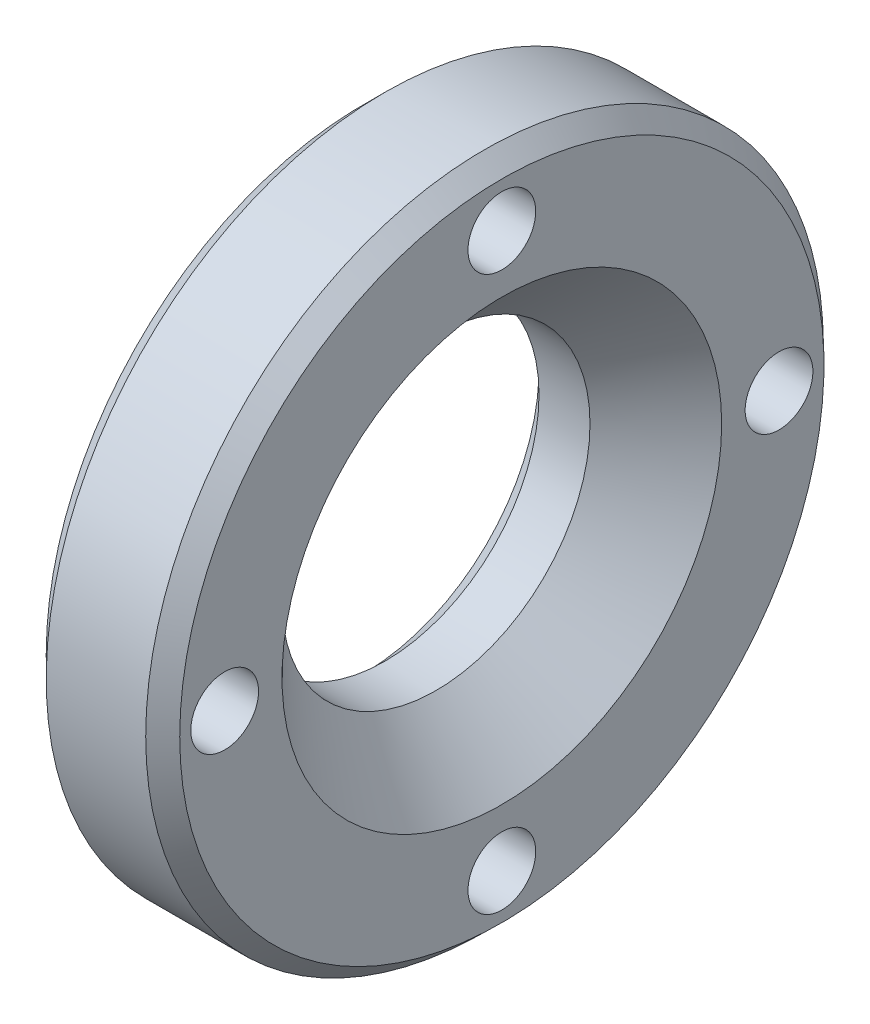
ISO-10303-21;
HEADER;
FILE_DESCRIPTION(('STEP AP214'),'2;1');
FILE_NAME('part.step','',(''),(''),'','','');
FILE_SCHEMA(('AUTOMOTIVE_DESIGN { 1 0 10303 214 1 1 1 1 }'));
ENDSEC;
DATA;
#1=APPLICATION_CONTEXT('core data for automotive mechanical design processes');
#2=APPLICATION_PROTOCOL_DEFINITION('international standard','automotive_design',2000,#1);
#3=PRODUCT_CONTEXT('',#1,'mechanical');
#4=PRODUCT('Part','Part','',(#3));
#5=PRODUCT_RELATED_PRODUCT_CATEGORY('part','',(#4));
#6=PRODUCT_DEFINITION_FORMATION('','',#4);
#7=PRODUCT_DEFINITION_CONTEXT('part definition',#1,'design');
#8=PRODUCT_DEFINITION('design','',#6,#7);
#9=PRODUCT_DEFINITION_SHAPE('','',#8);
#10=(LENGTH_UNIT() NAMED_UNIT(*) SI_UNIT(.MILLI.,.METRE.));
#11=(NAMED_UNIT(*) PLANE_ANGLE_UNIT() SI_UNIT($,.RADIAN.));
#12=(NAMED_UNIT(*) SI_UNIT($,.STERADIAN.) SOLID_ANGLE_UNIT());
#13=UNCERTAINTY_MEASURE_WITH_UNIT(LENGTH_MEASURE(1.E-05),#10,'distance_accuracy_value','');
#14=(GEOMETRIC_REPRESENTATION_CONTEXT(3) GLOBAL_UNCERTAINTY_ASSIGNED_CONTEXT((#13)) GLOBAL_UNIT_ASSIGNED_CONTEXT((#10,
#11,#12)) REPRESENTATION_CONTEXT('',''));
#15=CARTESIAN_POINT('',(0.,0.,0.));
#16=DIRECTION('',(0.,0.,1.));
#17=DIRECTION('',(1.,0.,0.));
#18=AXIS2_PLACEMENT_3D('',#15,#16,#17);
#19=CARTESIAN_POINT('',(19.5045,0.,8.45));
#20=DIRECTION('',(-1.,0.,0.));
#21=DIRECTION('',(0.,0.,1.));
#22=AXIS2_PLACEMENT_3D('',#19,#20,#21);
#23=PLANE('',#22);
#24=CARTESIAN_POINT('',(19.5045,0.,9.));
#25=DIRECTION('',(1.,0.,0.));
#26=DIRECTION('',(0.,0.,-1.));
#27=AXIS2_PLACEMENT_3D('',#24,#25,#26);
#28=CIRCLE('',#27,1.1);
#29=CARTESIAN_POINT('',(19.5045,0.,7.9));
#30=VERTEX_POINT('',#29);
#31=EDGE_CURVE('E18',#30,#30,#28,.T.);
#32=ORIENTED_EDGE('',*,*,#31,.T.);
#33=EDGE_LOOP('',(#32));
#34=FACE_BOUND('',#33,.T.);
#35=ADVANCED_FACE('F15',(#34),#23,.F.);
#36=CARTESIAN_POINT('',(19.5045,0.,-9.55));
#37=DIRECTION('',(-1.,0.,0.));
#38=DIRECTION('',(0.,0.,1.));
#39=AXIS2_PLACEMENT_3D('',#36,#37,#38);
#40=PLANE('',#39);
#41=CARTESIAN_POINT('',(19.5045,0.,-9.));
#42=DIRECTION('',(1.,0.,0.));
#43=DIRECTION('',(0.,0.,-1.));
#44=AXIS2_PLACEMENT_3D('',#41,#42,#43);
#45=CIRCLE('',#44,1.1);
#46=CARTESIAN_POINT('',(19.5045,0.,-10.1));
#47=VERTEX_POINT('',#46);
#48=EDGE_CURVE('E56',#47,#47,#45,.T.);
#49=ORIENTED_EDGE('',*,*,#48,.T.);
#50=EDGE_LOOP('',(#49));
#51=FACE_BOUND('',#50,.T.);
#52=ADVANCED_FACE('F130',(#51),#40,.F.);
#53=CARTESIAN_POINT('',(19.5045,-8.45,0.));
#54=DIRECTION('',(-1.,0.,0.));
#55=DIRECTION('',(0.,0.,1.));
#56=AXIS2_PLACEMENT_3D('',#53,#54,#55);
#57=PLANE('',#56);
#58=CARTESIAN_POINT('',(19.5045,-9.,0.));
#59=DIRECTION('',(1.,0.,0.));
#60=DIRECTION('',(0.,0.,-1.));
#61=AXIS2_PLACEMENT_3D('',#58,#59,#60);
#62=CIRCLE('',#61,1.1);
#63=CARTESIAN_POINT('',(19.5045,-9.,-1.1));
#64=VERTEX_POINT('',#63);
#65=EDGE_CURVE('E54',#64,#64,#62,.T.);
#66=ORIENTED_EDGE('',*,*,#65,.T.);
#67=EDGE_LOOP('',(#66));
#68=FACE_BOUND('',#67,.T.);
#69=ADVANCED_FACE('F78',(#68),#57,.F.);
#70=CARTESIAN_POINT('',(19.5045,9.55,0.));
#71=DIRECTION('',(-1.,0.,0.));
#72=DIRECTION('',(0.,0.,1.));
#73=AXIS2_PLACEMENT_3D('',#70,#71,#72);
#74=PLANE('',#73);
#75=CARTESIAN_POINT('',(19.5045,9.,0.));
#76=DIRECTION('',(1.,0.,0.));
#77=DIRECTION('',(0.,0.,-1.));
#78=AXIS2_PLACEMENT_3D('',#75,#76,#77);
#79=CIRCLE('',#78,1.1);
#80=CARTESIAN_POINT('',(19.5045,9.,-1.1));
#81=VERTEX_POINT('',#80);
#82=EDGE_CURVE('E51',#81,#81,#79,.T.);
#83=ORIENTED_EDGE('',*,*,#82,.T.);
#84=EDGE_LOOP('',(#83));
#85=FACE_BOUND('',#84,.T.);
#86=ADVANCED_FACE('F67',(#85),#74,.F.);
#87=CARTESIAN_POINT('',(21.25225,0.,9.));
#88=DIRECTION('',(1.,0.,0.));
#89=DIRECTION('',(0.,0.,-1.));
#90=AXIS2_PLACEMENT_3D('',#87,#88,#89);
#91=CYLINDRICAL_SURFACE('',#90,1.1);
#92=CARTESIAN_POINT('',(23.,0.,9.));
#93=DIRECTION('',(1.,0.,0.));
#94=DIRECTION('',(0.,0.,-1.));
#95=AXIS2_PLACEMENT_3D('',#92,#93,#94);
#96=CIRCLE('',#95,1.1);
#97=CARTESIAN_POINT('',(23.,0.,7.9));
#98=VERTEX_POINT('',#97);
#99=EDGE_CURVE('E48',#98,#98,#96,.F.);
#100=ORIENTED_EDGE('',*,*,#99,.F.);
#101=EDGE_LOOP('',(#100));
#102=FACE_BOUND('',#101,.T.);
#103=ORIENTED_EDGE('',*,*,#31,.F.);
#104=EDGE_LOOP('',(#103));
#105=FACE_BOUND('',#104,.T.);
#106=ADVANCED_FACE('F64',(#102,#105),#91,.F.);
#107=CARTESIAN_POINT('',(21.25225,0.,-9.));
#108=DIRECTION('',(1.,0.,0.));
#109=DIRECTION('',(0.,0.,-1.));
#110=AXIS2_PLACEMENT_3D('',#107,#108,#109);
#111=CYLINDRICAL_SURFACE('',#110,1.1);
#112=CARTESIAN_POINT('',(23.,0.,-9.));
#113=DIRECTION('',(1.,0.,0.));
#114=DIRECTION('',(0.,0.,-1.));
#115=AXIS2_PLACEMENT_3D('',#112,#113,#114);
#116=CIRCLE('',#115,1.1);
#117=CARTESIAN_POINT('',(23.,0.,-10.1));
#118=VERTEX_POINT('',#117);
#119=EDGE_CURVE('E45',#118,#118,#116,.F.);
#120=ORIENTED_EDGE('',*,*,#119,.F.);
#121=EDGE_LOOP('',(#120));
#122=FACE_BOUND('',#121,.T.);
#123=ORIENTED_EDGE('',*,*,#48,.F.);
#124=EDGE_LOOP('',(#123));
#125=FACE_BOUND('',#124,.T.);
#126=ADVANCED_FACE('F66',(#122,#125),#111,.F.);
#127=CARTESIAN_POINT('',(21.25225,-9.,0.));
#128=DIRECTION('',(1.,0.,0.));
#129=DIRECTION('',(0.,0.,-1.));
#130=AXIS2_PLACEMENT_3D('',#127,#128,#129);
#131=CYLINDRICAL_SURFACE('',#130,1.1);
#132=CARTESIAN_POINT('',(23.,-9.,0.));
#133=DIRECTION('',(1.,0.,0.));
#134=DIRECTION('',(0.,0.,-1.));
#135=AXIS2_PLACEMENT_3D('',#132,#133,#134);
#136=CIRCLE('',#135,1.1);
#137=CARTESIAN_POINT('',(23.,-9.,-1.1));
#138=VERTEX_POINT('',#137);
#139=EDGE_CURVE('E42',#138,#138,#136,.F.);
#140=ORIENTED_EDGE('',*,*,#139,.F.);
#141=EDGE_LOOP('',(#140));
#142=FACE_BOUND('',#141,.T.);
#143=ORIENTED_EDGE('',*,*,#65,.F.);
#144=EDGE_LOOP('',(#143));
#145=FACE_BOUND('',#144,.T.);
#146=ADVANCED_FACE('F75',(#142,#145),#131,.F.);
#147=CARTESIAN_POINT('',(21.25225,9.,0.));
#148=DIRECTION('',(1.,0.,0.));
#149=DIRECTION('',(0.,0.,-1.));
#150=AXIS2_PLACEMENT_3D('',#147,#148,#149);
#151=CYLINDRICAL_SURFACE('',#150,1.1);
#152=CARTESIAN_POINT('',(23.,9.,0.));
#153=DIRECTION('',(1.,0.,0.));
#154=DIRECTION('',(0.,0.,-1.));
#155=AXIS2_PLACEMENT_3D('',#152,#153,#154);
#156=CIRCLE('',#155,1.1);
#157=CARTESIAN_POINT('',(23.,9.,-1.1));
#158=VERTEX_POINT('',#157);
#159=EDGE_CURVE('E39',#158,#158,#156,.F.);
#160=ORIENTED_EDGE('',*,*,#159,.F.);
#161=EDGE_LOOP('',(#160));
#162=FACE_BOUND('',#161,.T.);
#163=ORIENTED_EDGE('',*,*,#82,.F.);
#164=EDGE_LOOP('',(#163));
#165=FACE_BOUND('',#164,.T.);
#166=ADVANCED_FACE('F116',(#162,#165),#151,.F.);
#167=CARTESIAN_POINT('',(23.,8.79797118908535,0.));
#168=DIRECTION('',(1.,0.,0.));
#169=DIRECTION('',(0.,0.,-1.));
#170=AXIS2_PLACEMENT_3D('',#167,#168,#169);
#171=PLANE('',#170);
#172=CARTESIAN_POINT('',(22.9999999999677,0.,0.));
#173=DIRECTION('',(1.,0.,0.));
#174=DIRECTION('',(0.,0.,-1.));
#175=AXIS2_PLACEMENT_3D('',#172,#173,#174);
#176=CIRCLE('',#175,7.13744237816627);
#177=CARTESIAN_POINT('',(22.9999999999677,0.,-7.13744237816627));
#178=VERTEX_POINT('',#177);
#179=EDGE_CURVE('E36',#178,#178,#176,.F.);
#180=ORIENTED_EDGE('',*,*,#179,.T.);
#181=EDGE_LOOP('',(#180));
#182=FACE_BOUND('',#181,.T.);
#183=CARTESIAN_POINT('',(23.,0.,0.));
#184=DIRECTION('',(-1.,0.,0.));
#185=DIRECTION('',(0.,0.,1.));
#186=AXIS2_PLACEMENT_3D('',#183,#184,#185);
#187=CIRCLE('',#186,10.4585);
#188=CARTESIAN_POINT('',(23.,0.,10.4585));
#189=VERTEX_POINT('',#188);
#190=EDGE_CURVE('E33',#189,#189,#187,.T.);
#191=ORIENTED_EDGE('',*,*,#190,.F.);
#192=EDGE_LOOP('',(#191));
#193=FACE_BOUND('',#192,.T.);
#194=ORIENTED_EDGE('',*,*,#159,.T.);
#195=EDGE_LOOP('',(#194));
#196=FACE_BOUND('',#195,.T.);
#197=ORIENTED_EDGE('',*,*,#139,.T.);
#198=EDGE_LOOP('',(#197));
#199=FACE_BOUND('',#198,.T.);
#200=ORIENTED_EDGE('',*,*,#119,.T.);
#201=EDGE_LOOP('',(#200));
#202=FACE_BOUND('',#201,.T.);
#203=ORIENTED_EDGE('',*,*,#99,.T.);
#204=EDGE_LOOP('',(#203));
#205=FACE_BOUND('',#204,.T.);
#206=ADVANCED_FACE('F112',(#182,#193,#196,#199,#202,#205),#171,.T.);
#207=CARTESIAN_POINT('',(22.9999999999677,0.,0.));
#208=DIRECTION('',(1.,0.,0.));
#209=DIRECTION('',(0.,0.,-1.));
#210=AXIS2_PLACEMENT_3D('',#207,#208,#209);
#211=CONICAL_SURFACE('',#210,7.13744237816627,0.785398163397448);
#212=ORIENTED_EDGE('',*,*,#179,.F.);
#213=EDGE_LOOP('',(#212));
#214=FACE_BOUND('',#213,.T.);
#215=CARTESIAN_POINT('',(20.8625576218293,0.,0.));
#216=DIRECTION('',(1.,0.,0.));
#217=DIRECTION('',(0.,0.,-1.));
#218=AXIS2_PLACEMENT_3D('',#215,#216,#217);
#219=CIRCLE('',#218,5.);
#220=CARTESIAN_POINT('',(20.8625576218293,0.,-5.));
#221=VERTEX_POINT('',#220);
#222=EDGE_CURVE('E30',#221,#221,#219,.F.);
#223=ORIENTED_EDGE('',*,*,#222,.T.);
#224=EDGE_LOOP('',(#223));
#225=FACE_BOUND('',#224,.T.);
#226=ADVANCED_FACE('F108',(#214,#225),#211,.F.);
#227=CARTESIAN_POINT('',(22.4368,0.,0.));
#228=DIRECTION('',(-1.,0.,0.));
#229=DIRECTION('',(0.,0.,1.));
#230=AXIS2_PLACEMENT_3D('',#227,#228,#229);
#231=CONICAL_SURFACE('',#230,11.,0.765757347261327);
#232=CARTESIAN_POINT('',(22.4368,0.,0.));
#233=DIRECTION('',(1.,0.,0.));
#234=DIRECTION('',(0.,0.,-1.));
#235=AXIS2_PLACEMENT_3D('',#232,#233,#234);
#236=CIRCLE('',#235,11.);
#237=CARTESIAN_POINT('',(22.4368,0.,-11.));
#238=VERTEX_POINT('',#237);
#239=EDGE_CURVE('E306',#238,#238,#236,.F.);
#240=ORIENTED_EDGE('',*,*,#239,.F.);
#241=EDGE_LOOP('',(#240));
#242=FACE_BOUND('',#241,.T.);
#243=ORIENTED_EDGE('',*,*,#190,.T.);
#244=EDGE_LOOP('',(#243));
#245=FACE_BOUND('',#244,.T.);
#246=ADVANCED_FACE('F104',(#242,#245),#231,.T.);
#247=CARTESIAN_POINT('',(20.0348322015079,0.,0.));
#248=DIRECTION('',(1.,0.,0.));
#249=DIRECTION('',(0.,0.,-1.));
#250=AXIS2_PLACEMENT_3D('',#247,#248,#249);
#251=CYLINDRICAL_SURFACE('',#250,5.);
#252=ORIENTED_EDGE('',*,*,#222,.F.);
#253=EDGE_LOOP('',(#252));
#254=FACE_BOUND('',#253,.T.);
#255=CARTESIAN_POINT('',(19.2071067812094,0.,0.));
#256=DIRECTION('',(-1.,0.,0.));
#257=DIRECTION('',(0.,1.,0.));
#258=AXIS2_PLACEMENT_3D('',#255,#256,#257);
#259=CIRCLE('',#258,4.99999999999545);
#260=CARTESIAN_POINT('',(19.2071067812094,4.99999999999545,0.));
#261=VERTEX_POINT('',#260);
#262=EDGE_CURVE('E308',#261,#261,#259,.T.);
#263=ORIENTED_EDGE('',*,*,#262,.T.);
#264=EDGE_LOOP('',(#263));
#265=FACE_BOUND('',#264,.T.);
#266=ADVANCED_FACE('F100',(#254,#265),#251,.F.);
#267=CARTESIAN_POINT('',(20.8219533905933,0.,0.));
#268=DIRECTION('',(1.,0.,0.));
#269=DIRECTION('',(0.,0.,-1.));
#270=AXIS2_PLACEMENT_3D('',#267,#268,#269);
#271=CYLINDRICAL_SURFACE('',#270,11.);
#272=CARTESIAN_POINT('',(19.2071067811865,0.,0.));
#273=DIRECTION('',(1.,0.,0.));
#274=DIRECTION('',(0.,1.,0.));
#275=AXIS2_PLACEMENT_3D('',#272,#273,#274);
#276=CIRCLE('',#275,10.9999999999999);
#277=CARTESIAN_POINT('',(19.2071067811865,10.9999999999999,0.));
#278=VERTEX_POINT('',#277);
#279=EDGE_CURVE('E27',#278,#278,#276,.F.);
#280=ORIENTED_EDGE('',*,*,#279,.F.);
#281=EDGE_LOOP('',(#280));
#282=FACE_BOUND('',#281,.T.);
#283=ORIENTED_EDGE('',*,*,#239,.T.);
#284=EDGE_LOOP('',(#283));
#285=FACE_BOUND('',#284,.T.);
#286=ADVANCED_FACE('F96',(#282,#285),#271,.T.);
#287=CARTESIAN_POINT('',(18.5000000000741,0.,0.));
#288=DIRECTION('',(-1.,0.,0.));
#289=DIRECTION('',(0.,0.,1.));
#290=AXIS2_PLACEMENT_3D('',#287,#288,#289);
#291=CONICAL_SURFACE('',#290,5.70710678118758,0.785398163437643);
#292=ORIENTED_EDGE('',*,*,#262,.F.);
#293=EDGE_LOOP('',(#292));
#294=FACE_BOUND('',#293,.T.);
#295=CARTESIAN_POINT('',(18.5000000000741,0.,0.));
#296=DIRECTION('',(-1.,0.,0.));
#297=DIRECTION('',(0.,0.,1.));
#298=AXIS2_PLACEMENT_3D('',#295,#296,#297);
#299=CIRCLE('',#298,5.70710678118758);
#300=CARTESIAN_POINT('',(18.5000000000741,0.,5.70710678118758));
#301=VERTEX_POINT('',#300);
#302=EDGE_CURVE('E22',#301,#301,#299,.F.);
#303=ORIENTED_EDGE('',*,*,#302,.F.);
#304=EDGE_LOOP('',(#303));
#305=FACE_BOUND('',#304,.T.);
#306=ADVANCED_FACE('F89',(#294,#305),#291,.F.);
#307=CARTESIAN_POINT('',(19.2071067811865,0.,0.));
#308=DIRECTION('',(1.,0.,0.));
#309=DIRECTION('',(0.,0.,-1.));
#310=AXIS2_PLACEMENT_3D('',#307,#308,#309);
#311=CONICAL_SURFACE('',#310,10.9999999999999,0.785398163397448);
#312=CARTESIAN_POINT('',(18.5,0.,0.));
#313=DIRECTION('',(1.,0.,0.));
#314=DIRECTION('',(0.,0.,-1.));
#315=AXIS2_PLACEMENT_3D('',#312,#313,#314);
#316=CIRCLE('',#315,10.2928932188134);
#317=CARTESIAN_POINT('',(18.5,0.,-10.2928932188134));
#318=VERTEX_POINT('',#317);
#319=EDGE_CURVE('E10',#318,#318,#316,.F.);
#320=ORIENTED_EDGE('',*,*,#319,.F.);
#321=EDGE_LOOP('',(#320));
#322=FACE_BOUND('',#321,.T.);
#323=ORIENTED_EDGE('',*,*,#279,.T.);
#324=EDGE_LOOP('',(#323));
#325=FACE_BOUND('',#324,.T.);
#326=ADVANCED_FACE('F84',(#322,#325),#311,.T.);
#327=CARTESIAN_POINT('',(18.5,8.,0.));
#328=DIRECTION('',(-1.,0.,0.));
#329=DIRECTION('',(0.,0.,1.));
#330=AXIS2_PLACEMENT_3D('',#327,#328,#329);
#331=PLANE('',#330);
#332=ORIENTED_EDGE('',*,*,#319,.T.);
#333=EDGE_LOOP('',(#332));
#334=FACE_BOUND('',#333,.T.);
#335=ORIENTED_EDGE('',*,*,#302,.T.);
#336=EDGE_LOOP('',(#335));
#337=FACE_BOUND('',#336,.T.);
#338=ADVANCED_FACE('F82',(#334,#337),#331,.T.);
#339=CLOSED_SHELL('',(#35,#52,#69,#86,#106,#126,#146,#166,#206,#226,#246,#266,#286,#306,#326,#338));
#340=MANIFOLD_SOLID_BREP('B1',#339);
#341=ADVANCED_BREP_SHAPE_REPRESENTATION('',(#18,#340),#14);
#342=SHAPE_DEFINITION_REPRESENTATION(#9,#341);
ENDSEC;
END-ISO-10303-21;
